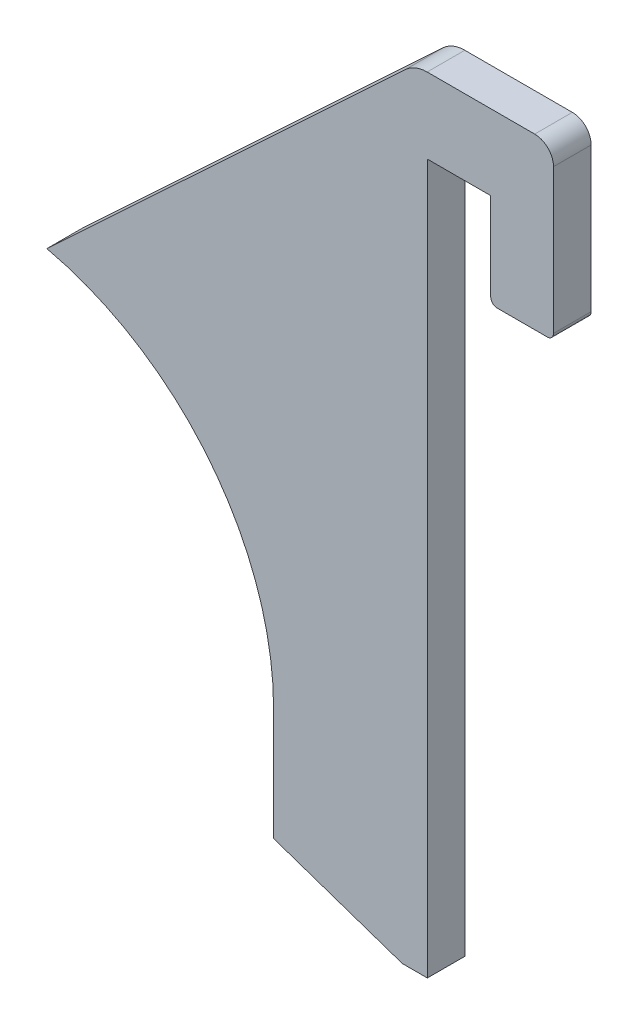
ISO-10303-21;
HEADER;
FILE_DESCRIPTION(('STEP AP214'),'2;1');
FILE_NAME('part.step','',(''),(''),'','','');
FILE_SCHEMA(('AUTOMOTIVE_DESIGN { 1 0 10303 214 1 1 1 1 }'));
ENDSEC;
DATA;
#1=APPLICATION_CONTEXT('core data for automotive mechanical design processes');
#2=APPLICATION_PROTOCOL_DEFINITION('international standard','automotive_design',2000,#1);
#3=PRODUCT_CONTEXT('',#1,'mechanical');
#4=PRODUCT('Part','Part','',(#3));
#5=PRODUCT_RELATED_PRODUCT_CATEGORY('part','',(#4));
#6=PRODUCT_DEFINITION_FORMATION('','',#4);
#7=PRODUCT_DEFINITION_CONTEXT('part definition',#1,'design');
#8=PRODUCT_DEFINITION('design','',#6,#7);
#9=PRODUCT_DEFINITION_SHAPE('','',#8);
#10=(LENGTH_UNIT() NAMED_UNIT(*) SI_UNIT(.MILLI.,.METRE.));
#11=(NAMED_UNIT(*) PLANE_ANGLE_UNIT() SI_UNIT($,.RADIAN.));
#12=(NAMED_UNIT(*) SI_UNIT($,.STERADIAN.) SOLID_ANGLE_UNIT());
#13=UNCERTAINTY_MEASURE_WITH_UNIT(LENGTH_MEASURE(1.E-05),#10,'distance_accuracy_value','');
#14=(GEOMETRIC_REPRESENTATION_CONTEXT(3) GLOBAL_UNCERTAINTY_ASSIGNED_CONTEXT((#13)) GLOBAL_UNIT_ASSIGNED_CONTEXT((#10,
#11,#12)) REPRESENTATION_CONTEXT('',''));
#15=CARTESIAN_POINT('',(0.,0.,0.));
#16=DIRECTION('',(0.,0.,1.));
#17=DIRECTION('',(1.,0.,0.));
#18=AXIS2_PLACEMENT_3D('',#15,#16,#17);
#19=CARTESIAN_POINT('',(69.,100.,6.));
#20=DIRECTION('',(0.681998360062503,-0.731353701619167,0.));
#21=DIRECTION('',(0.731353701619167,0.681998360062503,0.));
#22=AXIS2_PLACEMENT_3D('',#19,#20,#21);
#23=PLANE('',#22);
#24=DIRECTION('',(-0.731353701619167,-0.681998360062503,0.));
#25=VECTOR('',#24,1.);
#26=CARTESIAN_POINT('',(69.,100.,6.));
#27=LINE('',#26,#25);
#28=CARTESIAN_POINT('',(67.5595605777622,98.6567685080958,6.));
#29=VERTEX_POINT('',#28);
#30=CARTESIAN_POINT('',(10.3719829262458,45.3284896083872,6.));
#31=VERTEX_POINT('',#30);
#32=EDGE_CURVE('E144',#29,#31,#27,.T.);
#33=ORIENTED_EDGE('',*,*,#32,.F.);
#34=DIRECTION('',(0.,0.,-1.));
#35=VECTOR('',#34,1.);
#36=CARTESIAN_POINT('',(67.5595605777622,98.6567685080958,6.));
#37=LINE('',#36,#35);
#38=CARTESIAN_POINT('',(67.5595605777622,98.6567685080958,0.));
#39=VERTEX_POINT('',#38);
#40=EDGE_CURVE('E12',#29,#39,#37,.T.);
#41=ORIENTED_EDGE('',*,*,#40,.T.);
#42=DIRECTION('',(-0.731353701619167,-0.681998360062503,0.));
#43=VECTOR('',#42,1.);
#44=CARTESIAN_POINT('',(69.,100.,0.));
#45=LINE('',#44,#43);
#46=CARTESIAN_POINT('',(10.3719829262458,45.3284896083872,0.));
#47=VERTEX_POINT('',#46);
#48=EDGE_CURVE('E167',#39,#47,#45,.T.);
#49=ORIENTED_EDGE('',*,*,#48,.T.);
#50=DIRECTION('',(0.,0.,-1.));
#51=VECTOR('',#50,1.);
#52=CARTESIAN_POINT('',(10.3719829262458,45.3284896083872,6.));
#53=LINE('',#52,#51);
#54=EDGE_CURVE('E160',#31,#47,#53,.T.);
#55=ORIENTED_EDGE('',*,*,#54,.F.);
#56=EDGE_LOOP('',(#33,#41,#49,#55));
#57=FACE_BOUND('',#56,.T.);
#58=ADVANCED_FACE('F37',(#57),#23,.F.);
#59=CARTESIAN_POINT('',(0.,0.,6.));
#60=DIRECTION('',(0.,0.,-1.));
#61=DIRECTION('',(-1.,0.,0.));
#62=AXIS2_PLACEMENT_3D('',#59,#60,#61);
#63=CYLINDRICAL_SURFACE('',#62,46.5);
#64=CARTESIAN_POINT('',(0.,0.,0.));
#65=DIRECTION('',(0.,0.,-1.));
#66=DIRECTION('',(-1.,0.,0.));
#67=AXIS2_PLACEMENT_3D('',#64,#65,#66);
#68=CIRCLE('',#67,46.5);
#69=CARTESIAN_POINT('',(46.5,0.,0.));
#70=VERTEX_POINT('',#69);
#71=EDGE_CURVE('E246',#47,#70,#68,.T.);
#72=ORIENTED_EDGE('',*,*,#71,.T.);
#73=DIRECTION('',(0.,0.,-1.));
#74=VECTOR('',#73,1.);
#75=CARTESIAN_POINT('',(46.5,0.,6.));
#76=LINE('',#75,#74);
#77=CARTESIAN_POINT('',(46.5,0.,6.));
#78=VERTEX_POINT('',#77);
#79=EDGE_CURVE('E162',#78,#70,#76,.T.);
#80=ORIENTED_EDGE('',*,*,#79,.F.);
#81=CARTESIAN_POINT('',(0.,0.,6.));
#82=DIRECTION('',(0.,0.,-1.));
#83=DIRECTION('',(-1.,0.,0.));
#84=AXIS2_PLACEMENT_3D('',#81,#82,#83);
#85=CIRCLE('',#84,46.5);
#86=EDGE_CURVE('E148',#31,#78,#85,.T.);
#87=ORIENTED_EDGE('',*,*,#86,.F.);
#88=ORIENTED_EDGE('',*,*,#54,.T.);
#89=EDGE_LOOP('',(#72,#80,#87,#88));
#90=FACE_BOUND('',#89,.T.);
#91=ADVANCED_FACE('F159',(#90),#63,.F.);
#92=CARTESIAN_POINT('',(46.5,0.,6.));
#93=DIRECTION('',(1.,0.,0.));
#94=DIRECTION('',(0.,1.,0.));
#95=AXIS2_PLACEMENT_3D('',#92,#93,#94);
#96=PLANE('',#95);
#97=DIRECTION('',(0.,-1.,0.));
#98=VECTOR('',#97,1.);
#99=CARTESIAN_POINT('',(46.5,0.,0.));
#100=LINE('',#99,#98);
#101=CARTESIAN_POINT('',(46.5,-18.,0.));
#102=VERTEX_POINT('',#101);
#103=EDGE_CURVE('E240',#70,#102,#100,.T.);
#104=ORIENTED_EDGE('',*,*,#103,.T.);
#105=DIRECTION('',(0.,0.,-1.));
#106=VECTOR('',#105,1.);
#107=CARTESIAN_POINT('',(46.5,-18.,6.));
#108=LINE('',#107,#106);
#109=CARTESIAN_POINT('',(46.5,-18.,6.));
#110=VERTEX_POINT('',#109);
#111=EDGE_CURVE('E173',#110,#102,#108,.T.);
#112=ORIENTED_EDGE('',*,*,#111,.F.);
#113=DIRECTION('',(0.,-1.,0.));
#114=VECTOR('',#113,1.);
#115=CARTESIAN_POINT('',(46.5,0.,6.));
#116=LINE('',#115,#114);
#117=EDGE_CURVE('E164',#78,#110,#116,.T.);
#118=ORIENTED_EDGE('',*,*,#117,.F.);
#119=ORIENTED_EDGE('',*,*,#79,.T.);
#120=EDGE_LOOP('',(#104,#112,#118,#119));
#121=FACE_BOUND('',#120,.T.);
#122=ADVANCED_FACE('F278',(#121),#96,.F.);
#123=CARTESIAN_POINT('',(46.5,-18.,6.));
#124=DIRECTION('',(0.323143853291512,0.946349856067994,0.));
#125=DIRECTION('',(-0.946349856067995,0.323143853291512,0.));
#126=AXIS2_PLACEMENT_3D('',#123,#124,#125);
#127=PLANE('',#126);
#128=DIRECTION('',(0.946349856067994,-0.323143853291512,0.));
#129=VECTOR('',#128,1.);
#130=CARTESIAN_POINT('',(46.5,-18.,0.));
#131=LINE('',#130,#129);
#132=CARTESIAN_POINT('',(67.,-25.,0.));
#133=VERTEX_POINT('',#132);
#134=EDGE_CURVE('E235',#102,#133,#131,.T.);
#135=ORIENTED_EDGE('',*,*,#134,.T.);
#136=DIRECTION('',(0.,0.,-1.));
#137=VECTOR('',#136,1.);
#138=CARTESIAN_POINT('',(67.,-25.,6.));
#139=LINE('',#138,#137);
#140=CARTESIAN_POINT('',(67.,-25.,6.));
#141=VERTEX_POINT('',#140);
#142=EDGE_CURVE('E226',#141,#133,#139,.T.);
#143=ORIENTED_EDGE('',*,*,#142,.F.);
#144=DIRECTION('',(0.946349856067994,-0.323143853291512,0.));
#145=VECTOR('',#144,1.);
#146=CARTESIAN_POINT('',(46.5,-18.,6.));
#147=LINE('',#146,#145);
#148=EDGE_CURVE('E236',#110,#141,#147,.T.);
#149=ORIENTED_EDGE('',*,*,#148,.F.);
#150=ORIENTED_EDGE('',*,*,#111,.T.);
#151=EDGE_LOOP('',(#135,#143,#149,#150));
#152=FACE_BOUND('',#151,.T.);
#153=ADVANCED_FACE('F233',(#152),#127,.F.);
#154=CARTESIAN_POINT('',(67.,-25.,6.));
#155=DIRECTION('',(0.,1.,0.));
#156=DIRECTION('',(-1.,0.,0.));
#157=AXIS2_PLACEMENT_3D('',#154,#155,#156);
#158=PLANE('',#157);
#159=DIRECTION('',(1.,0.,0.));
#160=VECTOR('',#159,1.);
#161=CARTESIAN_POINT('',(67.,-25.,0.));
#162=LINE('',#161,#160);
#163=CARTESIAN_POINT('',(71.,-25.,0.));
#164=VERTEX_POINT('',#163);
#165=EDGE_CURVE('E242',#133,#164,#162,.T.);
#166=ORIENTED_EDGE('',*,*,#165,.T.);
#167=DIRECTION('',(0.,0.,-1.));
#168=VECTOR('',#167,1.);
#169=CARTESIAN_POINT('',(71.,-25.,6.));
#170=LINE('',#169,#168);
#171=CARTESIAN_POINT('',(71.,-25.,6.));
#172=VERTEX_POINT('',#171);
#173=EDGE_CURVE('E223',#172,#164,#170,.T.);
#174=ORIENTED_EDGE('',*,*,#173,.F.);
#175=DIRECTION('',(1.,0.,0.));
#176=VECTOR('',#175,1.);
#177=CARTESIAN_POINT('',(67.,-25.,6.));
#178=LINE('',#177,#176);
#179=EDGE_CURVE('E280',#141,#172,#178,.T.);
#180=ORIENTED_EDGE('',*,*,#179,.F.);
#181=ORIENTED_EDGE('',*,*,#142,.T.);
#182=EDGE_LOOP('',(#166,#174,#180,#181));
#183=FACE_BOUND('',#182,.T.);
#184=ADVANCED_FACE('F307',(#183),#158,.F.);
#185=CARTESIAN_POINT('',(71.,-25.,6.));
#186=DIRECTION('',(-1.,0.,0.));
#187=DIRECTION('',(0.,0.,1.));
#188=AXIS2_PLACEMENT_3D('',#185,#186,#187);
#189=PLANE('',#188);
#190=DIRECTION('',(0.,1.,0.));
#191=VECTOR('',#190,1.);
#192=CARTESIAN_POINT('',(71.,-25.,0.));
#193=LINE('',#192,#191);
#194=CARTESIAN_POINT('',(71.,88.,0.));
#195=VERTEX_POINT('',#194);
#196=EDGE_CURVE('E244',#164,#195,#193,.T.);
#197=ORIENTED_EDGE('',*,*,#196,.T.);
#198=DIRECTION('',(0.,0.,-1.));
#199=VECTOR('',#198,1.);
#200=CARTESIAN_POINT('',(71.,88.,6.));
#201=LINE('',#200,#199);
#202=CARTESIAN_POINT('',(71.,88.,6.));
#203=VERTEX_POINT('',#202);
#204=EDGE_CURVE('E220',#203,#195,#201,.T.);
#205=ORIENTED_EDGE('',*,*,#204,.F.);
#206=DIRECTION('',(0.,1.,0.));
#207=VECTOR('',#206,1.);
#208=CARTESIAN_POINT('',(71.,-25.,6.));
#209=LINE('',#208,#207);
#210=EDGE_CURVE('E284',#172,#203,#209,.T.);
#211=ORIENTED_EDGE('',*,*,#210,.F.);
#212=ORIENTED_EDGE('',*,*,#173,.T.);
#213=EDGE_LOOP('',(#197,#205,#211,#212));
#214=FACE_BOUND('',#213,.T.);
#215=ADVANCED_FACE('F302',(#214),#189,.F.);
#216=CARTESIAN_POINT('',(71.,88.,6.));
#217=DIRECTION('',(0.,1.,0.));
#218=DIRECTION('',(0.,0.,1.));
#219=AXIS2_PLACEMENT_3D('',#216,#217,#218);
#220=PLANE('',#219);
#221=DIRECTION('',(1.,0.,0.));
#222=VECTOR('',#221,1.);
#223=CARTESIAN_POINT('',(71.,88.,0.));
#224=LINE('',#223,#222);
#225=CARTESIAN_POINT('',(81.1,88.,0.));
#226=VERTEX_POINT('',#225);
#227=EDGE_CURVE('E251',#195,#226,#224,.T.);
#228=ORIENTED_EDGE('',*,*,#227,.T.);
#229=DIRECTION('',(0.,0.,-1.));
#230=VECTOR('',#229,1.);
#231=CARTESIAN_POINT('',(81.1,88.,6.));
#232=LINE('',#231,#230);
#233=CARTESIAN_POINT('',(81.1,88.,6.));
#234=VERTEX_POINT('',#233);
#235=EDGE_CURVE('E217',#234,#226,#232,.T.);
#236=ORIENTED_EDGE('',*,*,#235,.F.);
#237=DIRECTION('',(1.,0.,0.));
#238=VECTOR('',#237,1.);
#239=CARTESIAN_POINT('',(71.,88.,6.));
#240=LINE('',#239,#238);
#241=EDGE_CURVE('E286',#203,#234,#240,.T.);
#242=ORIENTED_EDGE('',*,*,#241,.F.);
#243=ORIENTED_EDGE('',*,*,#204,.T.);
#244=EDGE_LOOP('',(#228,#236,#242,#243));
#245=FACE_BOUND('',#244,.T.);
#246=ADVANCED_FACE('F299',(#245),#220,.F.);
#247=CARTESIAN_POINT('',(81.1,88.,6.));
#248=DIRECTION('',(1.,0.,0.));
#249=DIRECTION('',(0.,0.,-1.));
#250=AXIS2_PLACEMENT_3D('',#247,#248,#249);
#251=PLANE('',#250);
#252=DIRECTION('',(0.,-1.,0.));
#253=VECTOR('',#252,1.);
#254=CARTESIAN_POINT('',(81.1,88.,0.));
#255=LINE('',#254,#253);
#256=CARTESIAN_POINT('',(81.1,74.,0.));
#257=VERTEX_POINT('',#256);
#258=EDGE_CURVE('E253',#226,#257,#255,.T.);
#259=ORIENTED_EDGE('',*,*,#258,.T.);
#260=DIRECTION('',(0.,0.,-1.));
#261=VECTOR('',#260,1.);
#262=CARTESIAN_POINT('',(81.1,74.,6.));
#263=LINE('',#262,#261);
#264=CARTESIAN_POINT('',(81.1,74.,6.));
#265=VERTEX_POINT('',#264);
#266=EDGE_CURVE('E187',#257,#265,#263,.F.);
#267=ORIENTED_EDGE('',*,*,#266,.T.);
#268=DIRECTION('',(0.,-1.,0.));
#269=VECTOR('',#268,1.);
#270=CARTESIAN_POINT('',(81.1,88.,6.));
#271=LINE('',#270,#269);
#272=EDGE_CURVE('E274',#234,#265,#271,.T.);
#273=ORIENTED_EDGE('',*,*,#272,.F.);
#274=ORIENTED_EDGE('',*,*,#235,.T.);
#275=EDGE_LOOP('',(#259,#267,#273,#274));
#276=FACE_BOUND('',#275,.T.);
#277=ADVANCED_FACE('F297',(#276),#251,.F.);
#278=CARTESIAN_POINT('',(81.1,73.,6.));
#279=DIRECTION('',(0.,1.,0.));
#280=DIRECTION('',(-1.,0.,0.));
#281=AXIS2_PLACEMENT_3D('',#278,#279,#280);
#282=PLANE('',#281);
#283=DIRECTION('',(1.,0.,0.));
#284=VECTOR('',#283,1.);
#285=CARTESIAN_POINT('',(81.1,73.,6.));
#286=LINE('',#285,#284);
#287=CARTESIAN_POINT('',(82.1,73.,6.));
#288=VERTEX_POINT('',#287);
#289=CARTESIAN_POINT('',(90.1,73.,6.));
#290=VERTEX_POINT('',#289);
#291=EDGE_CURVE('E268',#288,#290,#286,.T.);
#292=ORIENTED_EDGE('',*,*,#291,.F.);
#293=DIRECTION('',(0.,0.,-1.));
#294=VECTOR('',#293,1.);
#295=CARTESIAN_POINT('',(82.1,73.,6.));
#296=LINE('',#295,#294);
#297=CARTESIAN_POINT('',(82.1,73.,0.));
#298=VERTEX_POINT('',#297);
#299=EDGE_CURVE('E171',#288,#298,#296,.T.);
#300=ORIENTED_EDGE('',*,*,#299,.T.);
#301=DIRECTION('',(1.,0.,0.));
#302=VECTOR('',#301,1.);
#303=CARTESIAN_POINT('',(81.1,73.,0.));
#304=LINE('',#303,#302);
#305=CARTESIAN_POINT('',(90.1,73.,0.));
#306=VERTEX_POINT('',#305);
#307=EDGE_CURVE('E213',#298,#306,#304,.T.);
#308=ORIENTED_EDGE('',*,*,#307,.T.);
#309=DIRECTION('',(0.,0.,-1.));
#310=VECTOR('',#309,1.);
#311=CARTESIAN_POINT('',(90.1,73.,6.));
#312=LINE('',#311,#310);
#313=EDGE_CURVE('E169',#306,#290,#312,.F.);
#314=ORIENTED_EDGE('',*,*,#313,.T.);
#315=EDGE_LOOP('',(#292,#300,#308,#314));
#316=FACE_BOUND('',#315,.T.);
#317=ADVANCED_FACE('F259',(#316),#282,.F.);
#318=CARTESIAN_POINT('',(91.1,73.,6.));
#319=DIRECTION('',(-1.,0.,0.));
#320=DIRECTION('',(0.,0.,1.));
#321=AXIS2_PLACEMENT_3D('',#318,#319,#320);
#322=PLANE('',#321);
#323=DIRECTION('',(0.,1.,0.));
#324=VECTOR('',#323,1.);
#325=CARTESIAN_POINT('',(91.1,73.,6.));
#326=LINE('',#325,#324);
#327=CARTESIAN_POINT('',(91.1,74.,6.));
#328=VERTEX_POINT('',#327);
#329=CARTESIAN_POINT('',(91.1,97.,6.));
#330=VERTEX_POINT('',#329);
#331=EDGE_CURVE('E267',#328,#330,#326,.T.);
#332=ORIENTED_EDGE('',*,*,#331,.F.);
#333=DIRECTION('',(0.,0.,-1.));
#334=VECTOR('',#333,1.);
#335=CARTESIAN_POINT('',(91.1,74.,6.));
#336=LINE('',#335,#334);
#337=CARTESIAN_POINT('',(91.1,74.,0.));
#338=VERTEX_POINT('',#337);
#339=EDGE_CURVE('E197',#328,#338,#336,.T.);
#340=ORIENTED_EDGE('',*,*,#339,.T.);
#341=DIRECTION('',(0.,1.,0.));
#342=VECTOR('',#341,1.);
#343=CARTESIAN_POINT('',(91.1,73.,0.));
#344=LINE('',#343,#342);
#345=CARTESIAN_POINT('',(91.1,97.,0.));
#346=VERTEX_POINT('',#345);
#347=EDGE_CURVE('E211',#338,#346,#344,.T.);
#348=ORIENTED_EDGE('',*,*,#347,.T.);
#349=DIRECTION('',(0.,0.,-1.));
#350=VECTOR('',#349,1.);
#351=CARTESIAN_POINT('',(91.1,97.,6.));
#352=LINE('',#351,#350);
#353=EDGE_CURVE('E195',#346,#330,#352,.F.);
#354=ORIENTED_EDGE('',*,*,#353,.T.);
#355=EDGE_LOOP('',(#332,#340,#348,#354));
#356=FACE_BOUND('',#355,.T.);
#357=ADVANCED_FACE('F270',(#356),#322,.F.);
#358=CARTESIAN_POINT('',(91.1,100.,6.));
#359=DIRECTION('',(0.,-1.,0.));
#360=DIRECTION('',(1.,0.,0.));
#361=AXIS2_PLACEMENT_3D('',#358,#359,#360);
#362=PLANE('',#361);
#363=DIRECTION('',(-1.,0.,0.));
#364=VECTOR('',#363,1.);
#365=CARTESIAN_POINT('',(91.1,100.,6.));
#366=LINE('',#365,#364);
#367=CARTESIAN_POINT('',(88.1,100.,6.));
#368=VERTEX_POINT('',#367);
#369=CARTESIAN_POINT('',(70.9695523780747,100.,6.));
#370=VERTEX_POINT('',#369);
#371=EDGE_CURVE('E204',#368,#370,#366,.T.);
#372=ORIENTED_EDGE('',*,*,#371,.F.);
#373=DIRECTION('',(0.,0.,-1.));
#374=VECTOR('',#373,1.);
#375=CARTESIAN_POINT('',(88.1,100.,6.));
#376=LINE('',#375,#374);
#377=CARTESIAN_POINT('',(88.1,100.,0.));
#378=VERTEX_POINT('',#377);
#379=EDGE_CURVE('E45',#368,#378,#376,.T.);
#380=ORIENTED_EDGE('',*,*,#379,.T.);
#381=DIRECTION('',(-1.,0.,0.));
#382=VECTOR('',#381,1.);
#383=CARTESIAN_POINT('',(91.1,100.,0.));
#384=LINE('',#383,#382);
#385=CARTESIAN_POINT('',(70.9695523780747,100.,0.));
#386=VERTEX_POINT('',#385);
#387=EDGE_CURVE('E155',#378,#386,#384,.T.);
#388=ORIENTED_EDGE('',*,*,#387,.T.);
#389=DIRECTION('',(0.,0.,-1.));
#390=VECTOR('',#389,1.);
#391=CARTESIAN_POINT('',(70.9695523780747,100.,6.));
#392=LINE('',#391,#390);
#393=EDGE_CURVE('E52',#386,#370,#392,.F.);
#394=ORIENTED_EDGE('',*,*,#393,.T.);
#395=EDGE_LOOP('',(#372,#380,#388,#394));
#396=FACE_BOUND('',#395,.T.);
#397=ADVANCED_FACE('F203',(#396),#362,.F.);
#398=CARTESIAN_POINT('',(0.,0.,6.));
#399=DIRECTION('',(0.,0.,-1.));
#400=DIRECTION('',(-1.,0.,0.));
#401=AXIS2_PLACEMENT_3D('',#398,#399,#400);
#402=PLANE('',#401);
#403=ORIENTED_EDGE('',*,*,#272,.T.);
#404=CARTESIAN_POINT('',(82.1,74.,6.));
#405=DIRECTION('',(0.,0.,-1.));
#406=DIRECTION('',(-1.,0.,0.));
#407=AXIS2_PLACEMENT_3D('',#404,#405,#406);
#408=CIRCLE('',#407,1.);
#409=EDGE_CURVE('E193',#265,#288,#408,.F.);
#410=ORIENTED_EDGE('',*,*,#409,.T.);
#411=ORIENTED_EDGE('',*,*,#291,.T.);
#412=CARTESIAN_POINT('',(90.1,74.,6.));
#413=DIRECTION('',(0.,0.,-1.));
#414=DIRECTION('',(-1.,0.,0.));
#415=AXIS2_PLACEMENT_3D('',#412,#413,#414);
#416=CIRCLE('',#415,1.);
#417=EDGE_CURVE('E191',#290,#328,#416,.F.);
#418=ORIENTED_EDGE('',*,*,#417,.T.);
#419=ORIENTED_EDGE('',*,*,#331,.T.);
#420=CARTESIAN_POINT('',(88.1,97.,6.));
#421=DIRECTION('',(0.,0.,-1.));
#422=DIRECTION('',(-1.,0.,0.));
#423=AXIS2_PLACEMENT_3D('',#420,#421,#422);
#424=CIRCLE('',#423,3.);
#425=EDGE_CURVE('E59',#330,#368,#424,.F.);
#426=ORIENTED_EDGE('',*,*,#425,.T.);
#427=ORIENTED_EDGE('',*,*,#371,.T.);
#428=CARTESIAN_POINT('',(70.9695523780747,95.,6.));
#429=DIRECTION('',(0.,0.,-1.));
#430=DIRECTION('',(-1.,0.,0.));
#431=AXIS2_PLACEMENT_3D('',#428,#429,#430);
#432=CIRCLE('',#431,5.);
#433=EDGE_CURVE('E151',#370,#29,#432,.F.);
#434=ORIENTED_EDGE('',*,*,#433,.T.);
#435=ORIENTED_EDGE('',*,*,#32,.T.);
#436=ORIENTED_EDGE('',*,*,#86,.T.);
#437=ORIENTED_EDGE('',*,*,#117,.T.);
#438=ORIENTED_EDGE('',*,*,#148,.T.);
#439=ORIENTED_EDGE('',*,*,#179,.T.);
#440=ORIENTED_EDGE('',*,*,#210,.T.);
#441=ORIENTED_EDGE('',*,*,#241,.T.);
#442=EDGE_LOOP('',(#403,#410,#411,#418,#419,#426,#427,#434,#435,#436,#437,#438,#439,#440,#441));
#443=FACE_BOUND('',#442,.T.);
#444=ADVANCED_FACE('F147',(#443),#402,.F.);
#445=CARTESIAN_POINT('',(0.,0.,0.));
#446=DIRECTION('',(0.,0.,-1.));
#447=DIRECTION('',(-1.,0.,0.));
#448=AXIS2_PLACEMENT_3D('',#445,#446,#447);
#449=PLANE('',#448);
#450=ORIENTED_EDGE('',*,*,#307,.F.);
#451=CARTESIAN_POINT('',(82.1,74.,0.));
#452=DIRECTION('',(0.,0.,-1.));
#453=DIRECTION('',(-1.,0.,0.));
#454=AXIS2_PLACEMENT_3D('',#451,#452,#453);
#455=CIRCLE('',#454,1.);
#456=EDGE_CURVE('E185',#298,#257,#455,.T.);
#457=ORIENTED_EDGE('',*,*,#456,.T.);
#458=ORIENTED_EDGE('',*,*,#258,.F.);
#459=ORIENTED_EDGE('',*,*,#227,.F.);
#460=ORIENTED_EDGE('',*,*,#196,.F.);
#461=ORIENTED_EDGE('',*,*,#165,.F.);
#462=ORIENTED_EDGE('',*,*,#134,.F.);
#463=ORIENTED_EDGE('',*,*,#103,.F.);
#464=ORIENTED_EDGE('',*,*,#71,.F.);
#465=ORIENTED_EDGE('',*,*,#48,.F.);
#466=CARTESIAN_POINT('',(70.9695523780747,95.,0.));
#467=DIRECTION('',(0.,0.,-1.));
#468=DIRECTION('',(-1.,0.,0.));
#469=AXIS2_PLACEMENT_3D('',#466,#467,#468);
#470=CIRCLE('',#469,5.);
#471=EDGE_CURVE('E179',#39,#386,#470,.T.);
#472=ORIENTED_EDGE('',*,*,#471,.T.);
#473=ORIENTED_EDGE('',*,*,#387,.F.);
#474=CARTESIAN_POINT('',(88.1,97.,0.));
#475=DIRECTION('',(0.,0.,-1.));
#476=DIRECTION('',(-1.,0.,0.));
#477=AXIS2_PLACEMENT_3D('',#474,#475,#476);
#478=CIRCLE('',#477,3.);
#479=EDGE_CURVE('E181',#378,#346,#478,.T.);
#480=ORIENTED_EDGE('',*,*,#479,.T.);
#481=ORIENTED_EDGE('',*,*,#347,.F.);
#482=CARTESIAN_POINT('',(90.1,74.,0.));
#483=DIRECTION('',(0.,0.,-1.));
#484=DIRECTION('',(-1.,0.,0.));
#485=AXIS2_PLACEMENT_3D('',#482,#483,#484);
#486=CIRCLE('',#485,1.);
#487=EDGE_CURVE('E183',#338,#306,#486,.T.);
#488=ORIENTED_EDGE('',*,*,#487,.T.);
#489=EDGE_LOOP('',(#450,#457,#458,#459,#460,#461,#462,#463,#464,#465,#472,#473,#480,#481,#488));
#490=FACE_BOUND('',#489,.T.);
#491=ADVANCED_FACE('F208',(#490),#449,.T.);
#492=CARTESIAN_POINT('',(82.1,74.,6.));
#493=DIRECTION('',(0.,0.,-1.));
#494=DIRECTION('',(-1.,0.,0.));
#495=AXIS2_PLACEMENT_3D('',#492,#493,#494);
#496=CYLINDRICAL_SURFACE('',#495,1.);
#497=ORIENTED_EDGE('',*,*,#409,.F.);
#498=ORIENTED_EDGE('',*,*,#266,.F.);
#499=ORIENTED_EDGE('',*,*,#456,.F.);
#500=ORIENTED_EDGE('',*,*,#299,.F.);
#501=EDGE_LOOP('',(#497,#498,#499,#500));
#502=FACE_BOUND('',#501,.T.);
#503=ADVANCED_FACE('F294',(#502),#496,.T.);
#504=CARTESIAN_POINT('',(90.1,74.,6.));
#505=DIRECTION('',(0.,0.,-1.));
#506=DIRECTION('',(-1.,0.,0.));
#507=AXIS2_PLACEMENT_3D('',#504,#505,#506);
#508=CYLINDRICAL_SURFACE('',#507,1.);
#509=ORIENTED_EDGE('',*,*,#417,.F.);
#510=ORIENTED_EDGE('',*,*,#313,.F.);
#511=ORIENTED_EDGE('',*,*,#487,.F.);
#512=ORIENTED_EDGE('',*,*,#339,.F.);
#513=EDGE_LOOP('',(#509,#510,#511,#512));
#514=FACE_BOUND('',#513,.T.);
#515=ADVANCED_FACE('F264',(#514),#508,.T.);
#516=CARTESIAN_POINT('',(88.1,97.,6.));
#517=DIRECTION('',(0.,0.,-1.));
#518=DIRECTION('',(-1.,0.,0.));
#519=AXIS2_PLACEMENT_3D('',#516,#517,#518);
#520=CYLINDRICAL_SURFACE('',#519,3.);
#521=ORIENTED_EDGE('',*,*,#425,.F.);
#522=ORIENTED_EDGE('',*,*,#353,.F.);
#523=ORIENTED_EDGE('',*,*,#479,.F.);
#524=ORIENTED_EDGE('',*,*,#379,.F.);
#525=EDGE_LOOP('',(#521,#522,#523,#524));
#526=FACE_BOUND('',#525,.T.);
#527=ADVANCED_FACE('F327',(#526),#520,.T.);
#528=CARTESIAN_POINT('',(70.9695523780747,95.,6.));
#529=DIRECTION('',(0.,0.,-1.));
#530=DIRECTION('',(-1.,0.,0.));
#531=AXIS2_PLACEMENT_3D('',#528,#529,#530);
#532=CYLINDRICAL_SURFACE('',#531,5.);
#533=ORIENTED_EDGE('',*,*,#433,.F.);
#534=ORIENTED_EDGE('',*,*,#393,.F.);
#535=ORIENTED_EDGE('',*,*,#471,.F.);
#536=ORIENTED_EDGE('',*,*,#40,.F.);
#537=EDGE_LOOP('',(#533,#534,#535,#536));
#538=FACE_BOUND('',#537,.T.);
#539=ADVANCED_FACE('F39',(#538),#532,.T.);
#540=CLOSED_SHELL('',(#58,#91,#122,#153,#184,#215,#246,#277,#317,#357,#397,#444,#491,#503,#515,
#527,#539));
#541=MANIFOLD_SOLID_BREP('B2',#540);
#542=ADVANCED_BREP_SHAPE_REPRESENTATION('',(#18,#541),#14);
#543=SHAPE_DEFINITION_REPRESENTATION(#9,#542);
ENDSEC;
END-ISO-10303-21;
